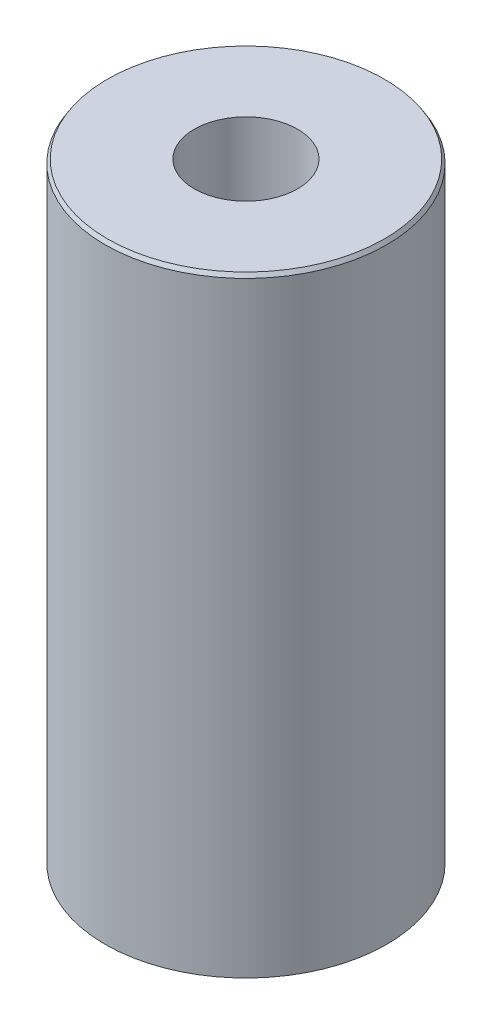
ISO-10303-21;
HEADER;
FILE_DESCRIPTION(('STEP AP214'),'2;1');
FILE_NAME('part.step','',(''),(''),'','','');
FILE_SCHEMA(('AUTOMOTIVE_DESIGN { 1 0 10303 214 1 1 1 1 }'));
ENDSEC;
DATA;
#1=APPLICATION_CONTEXT('core data for automotive mechanical design processes');
#2=APPLICATION_PROTOCOL_DEFINITION('international standard','automotive_design',2000,#1);
#3=PRODUCT_CONTEXT('',#1,'mechanical');
#4=PRODUCT('Part','Part','',(#3));
#5=PRODUCT_RELATED_PRODUCT_CATEGORY('part','',(#4));
#6=PRODUCT_DEFINITION_FORMATION('','',#4);
#7=PRODUCT_DEFINITION_CONTEXT('part definition',#1,'design');
#8=PRODUCT_DEFINITION('design','',#6,#7);
#9=PRODUCT_DEFINITION_SHAPE('','',#8);
#10=(LENGTH_UNIT() NAMED_UNIT(*) SI_UNIT(.MILLI.,.METRE.));
#11=(NAMED_UNIT(*) PLANE_ANGLE_UNIT() SI_UNIT($,.RADIAN.));
#12=(NAMED_UNIT(*) SI_UNIT($,.STERADIAN.) SOLID_ANGLE_UNIT());
#13=UNCERTAINTY_MEASURE_WITH_UNIT(LENGTH_MEASURE(1.E-05),#10,'distance_accuracy_value','');
#14=(GEOMETRIC_REPRESENTATION_CONTEXT(3) GLOBAL_UNCERTAINTY_ASSIGNED_CONTEXT((#13)) GLOBAL_UNIT_ASSIGNED_CONTEXT((#10,
#11,#12)) REPRESENTATION_CONTEXT('',''));
#15=CARTESIAN_POINT('',(0.,0.,0.));
#16=DIRECTION('',(0.,0.,1.));
#17=DIRECTION('',(1.,0.,0.));
#18=AXIS2_PLACEMENT_3D('',#15,#16,#17);
#19=CARTESIAN_POINT('',(0.,162.994726828372,0.));
#20=DIRECTION('',(0.,-1.,0.));
#21=DIRECTION('',(0.,0.,-1.));
#22=AXIS2_PLACEMENT_3D('',#19,#20,#21);
#23=CYLINDRICAL_SURFACE('',#22,37.5);
#24=CARTESIAN_POINT('',(0.,161.972946956285,0.));
#25=DIRECTION('',(0.,1.,0.));
#26=DIRECTION('',(0.,0.,1.));
#27=AXIS2_PLACEMENT_3D('',#24,#25,#26);
#28=CIRCLE('',#27,37.5);
#29=CARTESIAN_POINT('',(0.,161.972946956285,37.5));
#30=VERTEX_POINT('',#29);
#31=EDGE_CURVE('E50',#30,#30,#28,.F.);
#32=ORIENTED_EDGE('',*,*,#31,.T.);
#33=EDGE_LOOP('',(#32));
#34=FACE_BOUND('',#33,.T.);
#35=CARTESIAN_POINT('',(0.,0.6393246785458,0.));
#36=DIRECTION('',(0.,1.,0.));
#37=DIRECTION('',(0.,0.,1.));
#38=AXIS2_PLACEMENT_3D('',#35,#36,#37);
#39=CIRCLE('',#38,37.5);
#40=CARTESIAN_POINT('',(0.,0.6393246785458,37.5));
#41=VERTEX_POINT('',#40);
#42=EDGE_CURVE('E51',#41,#41,#39,.T.);
#43=ORIENTED_EDGE('',*,*,#42,.T.);
#44=EDGE_LOOP('',(#43));
#45=FACE_BOUND('',#44,.T.);
#46=ADVANCED_FACE('F39',(#34,#45),#23,.T.);
#47=CARTESIAN_POINT('',(0.,162.994726828372,0.));
#48=DIRECTION('',(0.,1.,0.));
#49=DIRECTION('',(0.,0.,1.));
#50=AXIS2_PLACEMENT_3D('',#47,#48,#49);
#51=PLANE('',#50);
#52=CARTESIAN_POINT('',(0.,162.994726828372,0.));
#53=DIRECTION('',(0.,1.,0.));
#54=DIRECTION('',(0.,0.,1.));
#55=AXIS2_PLACEMENT_3D('',#52,#53,#54);
#56=CIRCLE('',#55,36.8606753214542);
#57=CARTESIAN_POINT('',(0.,162.994726828372,36.8606753214542));
#58=VERTEX_POINT('',#57);
#59=EDGE_CURVE('E54',#58,#58,#56,.T.);
#60=ORIENTED_EDGE('',*,*,#59,.T.);
#61=EDGE_LOOP('',(#60));
#62=FACE_BOUND('',#61,.T.);
#63=CARTESIAN_POINT('',(0.,162.994726828372,0.));
#64=DIRECTION('',(0.,1.,0.));
#65=DIRECTION('',(0.,0.,1.));
#66=AXIS2_PLACEMENT_3D('',#63,#64,#65);
#67=CIRCLE('',#66,13.7650477010831);
#68=CARTESIAN_POINT('',(0.,162.994726828372,13.7650477010831));
#69=VERTEX_POINT('',#68);
#70=EDGE_CURVE('E58',#69,#69,#67,.T.);
#71=ORIENTED_EDGE('',*,*,#70,.F.);
#72=EDGE_LOOP('',(#71));
#73=FACE_BOUND('',#72,.T.);
#74=ADVANCED_FACE('F69',(#62,#73),#51,.T.);
#75=CARTESIAN_POINT('',(0.,0.,0.));
#76=DIRECTION('',(0.,1.,0.));
#77=DIRECTION('',(0.,0.,1.));
#78=AXIS2_PLACEMENT_3D('',#75,#76,#77);
#79=PLANE('',#78);
#80=CARTESIAN_POINT('',(0.,0.,0.));
#81=DIRECTION('',(0.,1.,0.));
#82=DIRECTION('',(0.,0.,1.));
#83=AXIS2_PLACEMENT_3D('',#80,#81,#82);
#84=CIRCLE('',#83,36.4782201279134);
#85=CARTESIAN_POINT('',(0.,0.,36.4782201279134));
#86=VERTEX_POINT('',#85);
#87=EDGE_CURVE('E10',#86,#86,#84,.F.);
#88=ORIENTED_EDGE('',*,*,#87,.T.);
#89=EDGE_LOOP('',(#88));
#90=FACE_BOUND('',#89,.T.);
#91=CARTESIAN_POINT('',(0.,0.,0.));
#92=DIRECTION('',(0.,1.,0.));
#93=DIRECTION('',(0.,0.,1.));
#94=AXIS2_PLACEMENT_3D('',#91,#92,#93);
#95=CIRCLE('',#94,13.7650477010831);
#96=CARTESIAN_POINT('',(0.,0.,13.7650477010831));
#97=VERTEX_POINT('',#96);
#98=EDGE_CURVE('E63',#97,#97,#95,.T.);
#99=ORIENTED_EDGE('',*,*,#98,.T.);
#100=EDGE_LOOP('',(#99));
#101=FACE_BOUND('',#100,.T.);
#102=ADVANCED_FACE('F75',(#90,#101),#79,.F.);
#103=CARTESIAN_POINT('',(0.,162.994726828372,0.));
#104=DIRECTION('',(0.,-1.,0.));
#105=DIRECTION('',(0.,0.,-1.));
#106=AXIS2_PLACEMENT_3D('',#103,#104,#105);
#107=CYLINDRICAL_SURFACE('',#106,13.7650477010831);
#108=ORIENTED_EDGE('',*,*,#70,.T.);
#109=EDGE_LOOP('',(#108));
#110=FACE_BOUND('',#109,.T.);
#111=ORIENTED_EDGE('',*,*,#98,.F.);
#112=EDGE_LOOP('',(#111));
#113=FACE_BOUND('',#112,.T.);
#114=ADVANCED_FACE('F70',(#110,#113),#107,.F.);
#115=CARTESIAN_POINT('',(0.,162.994726828372,0.));
#116=DIRECTION('',(0.,-1.,0.));
#117=DIRECTION('',(0.,0.,-1.));
#118=AXIS2_PLACEMENT_3D('',#115,#116,#117);
#119=CONICAL_SURFACE('',#118,36.8606753214542,0.559100426628822);
#120=ORIENTED_EDGE('',*,*,#31,.F.);
#121=EDGE_LOOP('',(#120));
#122=FACE_BOUND('',#121,.T.);
#123=ORIENTED_EDGE('',*,*,#59,.F.);
#124=EDGE_LOOP('',(#123));
#125=FACE_BOUND('',#124,.T.);
#126=ADVANCED_FACE('F81',(#122,#125),#119,.T.);
#127=CARTESIAN_POINT('',(0.,0.6393246785458,0.));
#128=DIRECTION('',(0.,1.,0.));
#129=DIRECTION('',(0.,0.,1.));
#130=AXIS2_PLACEMENT_3D('',#127,#128,#129);
#131=CONICAL_SURFACE('',#130,37.5,1.01169590016606);
#132=ORIENTED_EDGE('',*,*,#87,.F.);
#133=EDGE_LOOP('',(#132));
#134=FACE_BOUND('',#133,.T.);
#135=ORIENTED_EDGE('',*,*,#42,.F.);
#136=EDGE_LOOP('',(#135));
#137=FACE_BOUND('',#136,.T.);
#138=ADVANCED_FACE('F45',(#134,#137),#131,.T.);
#139=CLOSED_SHELL('',(#46,#74,#102,#114,#126,#138));
#140=MANIFOLD_SOLID_BREP('B2',#139);
#141=ADVANCED_BREP_SHAPE_REPRESENTATION('',(#18,#140),#14);
#142=SHAPE_DEFINITION_REPRESENTATION(#9,#141);
ENDSEC;
END-ISO-10303-21;
